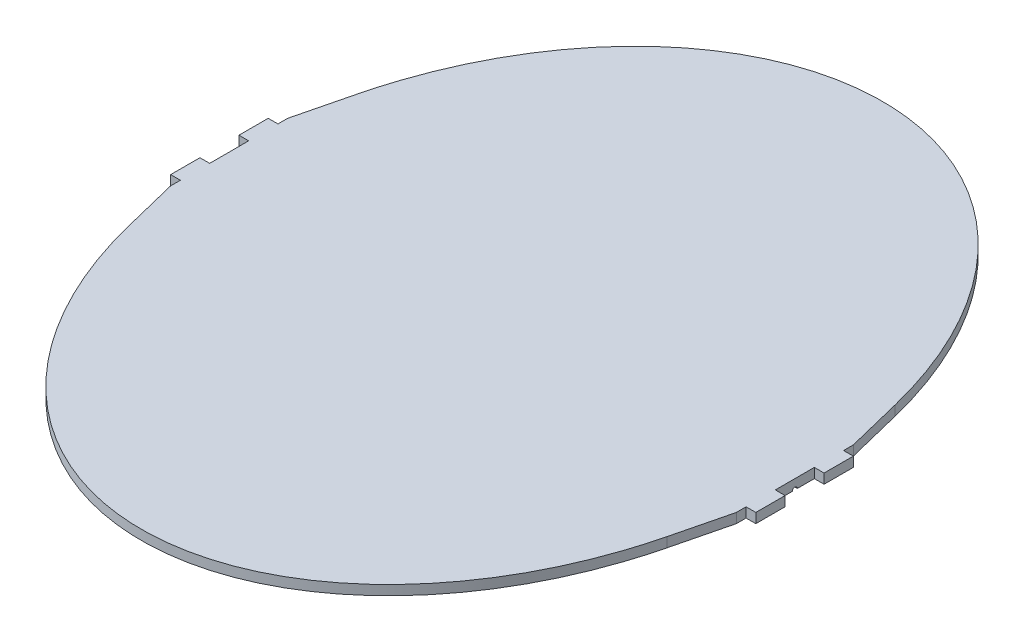
ISO-10303-21;
HEADER;
FILE_DESCRIPTION(('STEP AP214'),'2;1');
FILE_NAME('part.step','',(''),(''),'','','');
FILE_SCHEMA(('AUTOMOTIVE_DESIGN { 1 0 10303 214 1 1 1 1 }'));
ENDSEC;
DATA;
#1=APPLICATION_CONTEXT('core data for automotive mechanical design processes');
#2=APPLICATION_PROTOCOL_DEFINITION('international standard','automotive_design',2000,#1);
#3=PRODUCT_CONTEXT('',#1,'mechanical');
#4=PRODUCT('Part','Part','',(#3));
#5=PRODUCT_RELATED_PRODUCT_CATEGORY('part','',(#4));
#6=PRODUCT_DEFINITION_FORMATION('','',#4);
#7=PRODUCT_DEFINITION_CONTEXT('part definition',#1,'design');
#8=PRODUCT_DEFINITION('design','',#6,#7);
#9=PRODUCT_DEFINITION_SHAPE('','',#8);
#10=(LENGTH_UNIT() NAMED_UNIT(*) SI_UNIT(.MILLI.,.METRE.));
#11=(NAMED_UNIT(*) PLANE_ANGLE_UNIT() SI_UNIT($,.RADIAN.));
#12=(NAMED_UNIT(*) SI_UNIT($,.STERADIAN.) SOLID_ANGLE_UNIT());
#13=UNCERTAINTY_MEASURE_WITH_UNIT(LENGTH_MEASURE(1.E-05),#10,'distance_accuracy_value','');
#14=(GEOMETRIC_REPRESENTATION_CONTEXT(3) GLOBAL_UNCERTAINTY_ASSIGNED_CONTEXT((#13)) GLOBAL_UNIT_ASSIGNED_CONTEXT((#10,
#11,#12)) REPRESENTATION_CONTEXT('',''));
#15=CARTESIAN_POINT('',(0.,0.,0.));
#16=DIRECTION('',(0.,0.,1.));
#17=DIRECTION('',(1.,0.,0.));
#18=AXIS2_PLACEMENT_3D('',#15,#16,#17);
#19=CARTESIAN_POINT('',(0.,10.,0.));
#20=DIRECTION('',(0.,1.,0.));
#21=DIRECTION('',(0.,0.,-1.));
#22=AXIS2_PLACEMENT_3D('',#19,#20,#21);
#23=ELLIPSE('',#22,380.,290.);
#24=DIRECTION('',(0.,-1.,0.));
#25=VECTOR('',#24,1.);
#26=SURFACE_OF_LINEAR_EXTRUSION('',#23,#25);
#27=CARTESIAN_POINT('',(0.,0.,0.));
#28=DIRECTION('',(0.,1.,0.));
#29=DIRECTION('',(0.,0.,-1.));
#30=AXIS2_PLACEMENT_3D('',#27,#28,#29);
#31=ELLIPSE('',#30,380.,290.);
#32=CARTESIAN_POINT('',(275.891891891892,0.,-117.081081081081));
#33=VERTEX_POINT('',#32);
#34=CARTESIAN_POINT('',(-275.891891891892,0.,-117.081081081081));
#35=VERTEX_POINT('',#34);
#36=EDGE_CURVE('E38',#33,#35,#31,.T.);
#37=ORIENTED_EDGE('',*,*,#36,.T.);
#38=DIRECTION('',(0.,1.,0.));
#39=VECTOR('',#38,1.);
#40=CARTESIAN_POINT('',(-275.891891891892,0.,-117.081081081081));
#41=LINE('',#40,#39);
#42=CARTESIAN_POINT('',(-275.891891891892,10.,-117.081081081081));
#43=VERTEX_POINT('',#42);
#44=EDGE_CURVE('E336',#35,#43,#41,.T.);
#45=ORIENTED_EDGE('',*,*,#44,.T.);
#46=CARTESIAN_POINT('',(275.891891891892,10.,-117.081081081081));
#47=VERTEX_POINT('',#46);
#48=EDGE_CURVE('E11',#47,#43,#23,.T.);
#49=ORIENTED_EDGE('',*,*,#48,.F.);
#50=DIRECTION('',(0.,1.,0.));
#51=VECTOR('',#50,1.);
#52=CARTESIAN_POINT('',(275.891891891892,0.,-117.081081081081));
#53=LINE('',#52,#51);
#54=EDGE_CURVE('E405',#33,#47,#53,.T.);
#55=ORIENTED_EDGE('',*,*,#54,.F.);
#56=EDGE_LOOP('',(#37,#45,#49,#55));
#57=FACE_BOUND('',#56,.T.);
#58=ADVANCED_FACE('F33',(#57),#26,.F.);
#59=CARTESIAN_POINT('',(-275.891891891892,10.,117.081081081081));
#60=VERTEX_POINT('',#59);
#61=CARTESIAN_POINT('',(275.891891891892,10.,117.081081081081));
#62=VERTEX_POINT('',#61);
#63=EDGE_CURVE('E42',#60,#62,#23,.T.);
#64=ORIENTED_EDGE('',*,*,#63,.F.);
#65=DIRECTION('',(0.,1.,0.));
#66=VECTOR('',#65,1.);
#67=CARTESIAN_POINT('',(-275.891891891892,0.,117.081081081081));
#68=LINE('',#67,#66);
#69=CARTESIAN_POINT('',(-275.891891891892,0.,117.081081081081));
#70=VERTEX_POINT('',#69);
#71=EDGE_CURVE('E283',#70,#60,#68,.T.);
#72=ORIENTED_EDGE('',*,*,#71,.F.);
#73=CARTESIAN_POINT('',(275.891891891892,0.,117.081081081081));
#74=VERTEX_POINT('',#73);
#75=EDGE_CURVE('E408',#70,#74,#31,.T.);
#76=ORIENTED_EDGE('',*,*,#75,.T.);
#77=DIRECTION('',(0.,1.,0.));
#78=VECTOR('',#77,1.);
#79=CARTESIAN_POINT('',(275.891891891892,0.,117.081081081081));
#80=LINE('',#79,#78);
#81=EDGE_CURVE('E375',#74,#62,#80,.T.);
#82=ORIENTED_EDGE('',*,*,#81,.T.);
#83=EDGE_LOOP('',(#64,#72,#76,#82));
#84=FACE_BOUND('',#83,.T.);
#85=ADVANCED_FACE('F35',(#84),#26,.F.);
#86=CARTESIAN_POINT('',(0.,10.,0.));
#87=DIRECTION('',(0.,1.,0.));
#88=DIRECTION('',(0.,0.,1.));
#89=AXIS2_PLACEMENT_3D('',#86,#87,#88);
#90=PLANE('',#89);
#91=ORIENTED_EDGE('',*,*,#48,.T.);
#92=DIRECTION('',(-0.239939067208134,0.,0.970787950083483));
#93=VECTOR('',#92,1.);
#94=CARTESIAN_POINT('',(-275.891891891892,10.,-117.081081081081));
#95=LINE('',#94,#93);
#96=CARTESIAN_POINT('',(-290.,10.,-59.9999999999999));
#97=VERTEX_POINT('',#96);
#98=EDGE_CURVE('E285',#43,#97,#95,.T.);
#99=ORIENTED_EDGE('',*,*,#98,.T.);
#100=DIRECTION('',(0.,0.,1.));
#101=VECTOR('',#100,1.);
#102=CARTESIAN_POINT('',(-290.,10.,-59.9999999999999));
#103=LINE('',#102,#101);
#104=CARTESIAN_POINT('',(-290.,10.,-50.));
#105=VERTEX_POINT('',#104);
#106=EDGE_CURVE('E288',#97,#105,#103,.T.);
#107=ORIENTED_EDGE('',*,*,#106,.T.);
#108=DIRECTION('',(-1.,0.,0.));
#109=VECTOR('',#108,1.);
#110=CARTESIAN_POINT('',(-300.,10.,-50.));
#111=LINE('',#110,#109);
#112=CARTESIAN_POINT('',(-300.,10.,-50.));
#113=VERTEX_POINT('',#112);
#114=EDGE_CURVE('E291',#105,#113,#111,.T.);
#115=ORIENTED_EDGE('',*,*,#114,.T.);
#116=DIRECTION('',(0.,0.,1.));
#117=VECTOR('',#116,1.);
#118=CARTESIAN_POINT('',(-300.,10.,-20.));
#119=LINE('',#118,#117);
#120=CARTESIAN_POINT('',(-300.,10.,-20.));
#121=VERTEX_POINT('',#120);
#122=EDGE_CURVE('E294',#113,#121,#119,.T.);
#123=ORIENTED_EDGE('',*,*,#122,.T.);
#124=DIRECTION('',(1.,0.,0.));
#125=VECTOR('',#124,1.);
#126=CARTESIAN_POINT('',(-290.,10.,-19.9999999999999));
#127=LINE('',#126,#125);
#128=CARTESIAN_POINT('',(-290.,10.,-19.9999999999999));
#129=VERTEX_POINT('',#128);
#130=EDGE_CURVE('E297',#121,#129,#127,.T.);
#131=ORIENTED_EDGE('',*,*,#130,.T.);
#132=DIRECTION('',(0.,0.,1.));
#133=VECTOR('',#132,1.);
#134=CARTESIAN_POINT('',(-290.,10.,0.));
#135=LINE('',#134,#133);
#136=CARTESIAN_POINT('',(-290.,10.,20.0000000000001));
#137=VERTEX_POINT('',#136);
#138=EDGE_CURVE('E300',#129,#137,#135,.T.);
#139=ORIENTED_EDGE('',*,*,#138,.T.);
#140=DIRECTION('',(-1.,0.,0.));
#141=VECTOR('',#140,1.);
#142=CARTESIAN_POINT('',(-300.,10.,20.));
#143=LINE('',#142,#141);
#144=CARTESIAN_POINT('',(-300.,10.,20.));
#145=VERTEX_POINT('',#144);
#146=EDGE_CURVE('E302',#137,#145,#143,.T.);
#147=ORIENTED_EDGE('',*,*,#146,.T.);
#148=DIRECTION('',(0.,0.,1.));
#149=VECTOR('',#148,1.);
#150=CARTESIAN_POINT('',(-300.,10.,50.));
#151=LINE('',#150,#149);
#152=CARTESIAN_POINT('',(-300.,10.,50.));
#153=VERTEX_POINT('',#152);
#154=EDGE_CURVE('E305',#145,#153,#151,.T.);
#155=ORIENTED_EDGE('',*,*,#154,.T.);
#156=DIRECTION('',(1.,0.,0.));
#157=VECTOR('',#156,1.);
#158=CARTESIAN_POINT('',(-290.,10.,50.));
#159=LINE('',#158,#157);
#160=CARTESIAN_POINT('',(-290.,10.,50.));
#161=VERTEX_POINT('',#160);
#162=EDGE_CURVE('E308',#153,#161,#159,.T.);
#163=ORIENTED_EDGE('',*,*,#162,.T.);
#164=DIRECTION('',(0.,0.,1.));
#165=VECTOR('',#164,1.);
#166=CARTESIAN_POINT('',(-290.,10.,50.));
#167=LINE('',#166,#165);
#168=CARTESIAN_POINT('',(-290.,10.,59.9999999999999));
#169=VERTEX_POINT('',#168);
#170=EDGE_CURVE('E254',#161,#169,#167,.T.);
#171=ORIENTED_EDGE('',*,*,#170,.T.);
#172=DIRECTION('',(0.239939067208133,0.,0.970787950083483));
#173=VECTOR('',#172,1.);
#174=CARTESIAN_POINT('',(-290.,10.,59.9999999999999));
#175=LINE('',#174,#173);
#176=EDGE_CURVE('E248',#169,#60,#175,.T.);
#177=ORIENTED_EDGE('',*,*,#176,.T.);
#178=ORIENTED_EDGE('',*,*,#63,.T.);
#179=DIRECTION('',(0.239939067208134,0.,-0.970787950083483));
#180=VECTOR('',#179,1.);
#181=CARTESIAN_POINT('',(290.,10.,60.));
#182=LINE('',#181,#180);
#183=CARTESIAN_POINT('',(290.,10.,60.));
#184=VERTEX_POINT('',#183);
#185=EDGE_CURVE('E315',#62,#184,#182,.T.);
#186=ORIENTED_EDGE('',*,*,#185,.T.);
#187=DIRECTION('',(0.,0.,-1.));
#188=VECTOR('',#187,1.);
#189=CARTESIAN_POINT('',(290.,10.,50.));
#190=LINE('',#189,#188);
#191=CARTESIAN_POINT('',(290.,10.,50.));
#192=VERTEX_POINT('',#191);
#193=EDGE_CURVE('E378',#184,#192,#190,.T.);
#194=ORIENTED_EDGE('',*,*,#193,.T.);
#195=DIRECTION('',(1.,0.,0.));
#196=VECTOR('',#195,1.);
#197=CARTESIAN_POINT('',(290.,10.,50.));
#198=LINE('',#197,#196);
#199=CARTESIAN_POINT('',(300.,10.,50.));
#200=VERTEX_POINT('',#199);
#201=EDGE_CURVE('E381',#192,#200,#198,.T.);
#202=ORIENTED_EDGE('',*,*,#201,.T.);
#203=DIRECTION('',(0.,0.,-1.));
#204=VECTOR('',#203,1.);
#205=CARTESIAN_POINT('',(300.,10.,50.));
#206=LINE('',#205,#204);
#207=CARTESIAN_POINT('',(300.,10.,20.));
#208=VERTEX_POINT('',#207);
#209=EDGE_CURVE('E384',#200,#208,#206,.T.);
#210=ORIENTED_EDGE('',*,*,#209,.T.);
#211=DIRECTION('',(-1.,0.,0.));
#212=VECTOR('',#211,1.);
#213=CARTESIAN_POINT('',(300.,10.,20.));
#214=LINE('',#213,#212);
#215=CARTESIAN_POINT('',(290.,10.,20.));
#216=VERTEX_POINT('',#215);
#217=EDGE_CURVE('E387',#208,#216,#214,.T.);
#218=ORIENTED_EDGE('',*,*,#217,.T.);
#219=DIRECTION('',(0.,0.,-1.));
#220=VECTOR('',#219,1.);
#221=CARTESIAN_POINT('',(290.,10.,-20.));
#222=LINE('',#221,#220);
#223=CARTESIAN_POINT('',(290.,10.,-20.));
#224=VERTEX_POINT('',#223);
#225=EDGE_CURVE('E390',#216,#224,#222,.T.);
#226=ORIENTED_EDGE('',*,*,#225,.T.);
#227=DIRECTION('',(1.,0.,0.));
#228=VECTOR('',#227,1.);
#229=CARTESIAN_POINT('',(290.,10.,-20.));
#230=LINE('',#229,#228);
#231=CARTESIAN_POINT('',(300.,10.,-20.));
#232=VERTEX_POINT('',#231);
#233=EDGE_CURVE('E392',#224,#232,#230,.T.);
#234=ORIENTED_EDGE('',*,*,#233,.T.);
#235=DIRECTION('',(0.,0.,-1.));
#236=VECTOR('',#235,1.);
#237=CARTESIAN_POINT('',(300.,10.,-20.));
#238=LINE('',#237,#236);
#239=CARTESIAN_POINT('',(300.,10.,-50.));
#240=VERTEX_POINT('',#239);
#241=EDGE_CURVE('E395',#232,#240,#238,.T.);
#242=ORIENTED_EDGE('',*,*,#241,.T.);
#243=DIRECTION('',(-1.,0.,0.));
#244=VECTOR('',#243,1.);
#245=CARTESIAN_POINT('',(300.,10.,-50.));
#246=LINE('',#245,#244);
#247=CARTESIAN_POINT('',(290.,10.,-50.));
#248=VERTEX_POINT('',#247);
#249=EDGE_CURVE('E398',#240,#248,#246,.T.);
#250=ORIENTED_EDGE('',*,*,#249,.T.);
#251=DIRECTION('',(0.,0.,-1.));
#252=VECTOR('',#251,1.);
#253=CARTESIAN_POINT('',(290.,10.,-60.));
#254=LINE('',#253,#252);
#255=CARTESIAN_POINT('',(290.,10.,-60.));
#256=VERTEX_POINT('',#255);
#257=EDGE_CURVE('E401',#248,#256,#254,.T.);
#258=ORIENTED_EDGE('',*,*,#257,.T.);
#259=DIRECTION('',(-0.239939067208134,0.,-0.970787950083483));
#260=VECTOR('',#259,1.);
#261=CARTESIAN_POINT('',(275.891891891892,10.,-117.081081081081));
#262=LINE('',#261,#260);
#263=EDGE_CURVE('E345',#256,#47,#262,.T.);
#264=ORIENTED_EDGE('',*,*,#263,.T.);
#265=EDGE_LOOP('',(#91,#99,#107,#115,#123,#131,#139,#147,#155,#163,#171,#177,#178,#186,#194,
#202,#210,#218,#226,#234,#242,#250,#258,#264));
#266=FACE_BOUND('',#265,.T.);
#267=ADVANCED_FACE('F451',(#266),#90,.T.);
#268=CARTESIAN_POINT('',(0.,0.,0.));
#269=DIRECTION('',(0.,1.,0.));
#270=DIRECTION('',(0.,0.,1.));
#271=AXIS2_PLACEMENT_3D('',#268,#269,#270);
#272=PLANE('',#271);
#273=DIRECTION('',(0.,0.,1.));
#274=VECTOR('',#273,1.);
#275=CARTESIAN_POINT('',(-279.999999999999,0.,-57.5));
#276=LINE('',#275,#274);
#277=CARTESIAN_POINT('',(-279.999999999999,0.,-57.5));
#278=VERTEX_POINT('',#277);
#279=CARTESIAN_POINT('',(-279.999999999999,0.,-52.5));
#280=VERTEX_POINT('',#279);
#281=EDGE_CURVE('E227',#278,#280,#276,.T.);
#282=ORIENTED_EDGE('',*,*,#281,.F.);
#283=DIRECTION('',(-1.,0.,0.));
#284=VECTOR('',#283,1.);
#285=CARTESIAN_POINT('',(-279.999999999999,0.,-57.5));
#286=LINE('',#285,#284);
#287=CARTESIAN_POINT('',(-289.999999999999,0.,-57.5));
#288=VERTEX_POINT('',#287);
#289=EDGE_CURVE('E217',#278,#288,#286,.T.);
#290=ORIENTED_EDGE('',*,*,#289,.T.);
#291=DIRECTION('',(0.,0.,1.));
#292=VECTOR('',#291,1.);
#293=CARTESIAN_POINT('',(-290.,0.,-59.9999999999999));
#294=LINE('',#293,#292);
#295=CARTESIAN_POINT('',(-290.,0.,-59.9999999999999));
#296=VERTEX_POINT('',#295);
#297=EDGE_CURVE('E258',#296,#288,#294,.T.);
#298=ORIENTED_EDGE('',*,*,#297,.F.);
#299=DIRECTION('',(-0.239939067208134,0.,0.970787950083483));
#300=VECTOR('',#299,1.);
#301=CARTESIAN_POINT('',(-275.891891891892,0.,-117.081081081081));
#302=LINE('',#301,#300);
#303=EDGE_CURVE('E253',#35,#296,#302,.T.);
#304=ORIENTED_EDGE('',*,*,#303,.F.);
#305=ORIENTED_EDGE('',*,*,#36,.F.);
#306=DIRECTION('',(-0.239939067208134,0.,-0.970787950083483));
#307=VECTOR('',#306,1.);
#308=CARTESIAN_POINT('',(275.891891891892,0.,-117.081081081081));
#309=LINE('',#308,#307);
#310=CARTESIAN_POINT('',(290.,0.,-60.));
#311=VERTEX_POINT('',#310);
#312=EDGE_CURVE('E373',#311,#33,#309,.T.);
#313=ORIENTED_EDGE('',*,*,#312,.F.);
#314=DIRECTION('',(0.,0.,-1.));
#315=VECTOR('',#314,1.);
#316=CARTESIAN_POINT('',(290.,0.,-60.));
#317=LINE('',#316,#315);
#318=CARTESIAN_POINT('',(290.,0.,-50.));
#319=VERTEX_POINT('',#318);
#320=EDGE_CURVE('E370',#319,#311,#317,.T.);
#321=ORIENTED_EDGE('',*,*,#320,.F.);
#322=DIRECTION('',(-1.,0.,0.));
#323=VECTOR('',#322,1.);
#324=CARTESIAN_POINT('',(300.,0.,-50.));
#325=LINE('',#324,#323);
#326=CARTESIAN_POINT('',(300.,0.,-50.));
#327=VERTEX_POINT('',#326);
#328=EDGE_CURVE('E367',#327,#319,#325,.T.);
#329=ORIENTED_EDGE('',*,*,#328,.F.);
#330=DIRECTION('',(0.,0.,-1.));
#331=VECTOR('',#330,1.);
#332=CARTESIAN_POINT('',(300.,0.,-20.));
#333=LINE('',#332,#331);
#334=CARTESIAN_POINT('',(300.,0.,-20.));
#335=VERTEX_POINT('',#334);
#336=EDGE_CURVE('E364',#335,#327,#333,.T.);
#337=ORIENTED_EDGE('',*,*,#336,.F.);
#338=DIRECTION('',(1.,0.,0.));
#339=VECTOR('',#338,1.);
#340=CARTESIAN_POINT('',(290.,0.,-20.));
#341=LINE('',#340,#339);
#342=CARTESIAN_POINT('',(290.,0.,-20.));
#343=VERTEX_POINT('',#342);
#344=EDGE_CURVE('E361',#343,#335,#341,.T.);
#345=ORIENTED_EDGE('',*,*,#344,.F.);
#346=DIRECTION('',(0.,0.,-1.));
#347=VECTOR('',#346,1.);
#348=CARTESIAN_POINT('',(290.,0.,0.));
#349=LINE('',#348,#347);
#350=CARTESIAN_POINT('',(290.,0.,-2.5));
#351=VERTEX_POINT('',#350);
#352=EDGE_CURVE('E357',#351,#343,#349,.T.);
#353=ORIENTED_EDGE('',*,*,#352,.F.);
#354=DIRECTION('',(1.,0.,0.));
#355=VECTOR('',#354,1.);
#356=CARTESIAN_POINT('',(280.,0.,-2.5));
#357=LINE('',#356,#355);
#358=CARTESIAN_POINT('',(280.,0.,-2.5));
#359=VERTEX_POINT('',#358);
#360=EDGE_CURVE('E57',#359,#351,#357,.T.);
#361=ORIENTED_EDGE('',*,*,#360,.F.);
#362=DIRECTION('',(0.,0.,-1.));
#363=VECTOR('',#362,1.);
#364=CARTESIAN_POINT('',(280.,0.,2.5));
#365=LINE('',#364,#363);
#366=CARTESIAN_POINT('',(280.,0.,2.5));
#367=VERTEX_POINT('',#366);
#368=EDGE_CURVE('E242',#367,#359,#365,.T.);
#369=ORIENTED_EDGE('',*,*,#368,.F.);
#370=DIRECTION('',(1.,0.,0.));
#371=VECTOR('',#370,1.);
#372=CARTESIAN_POINT('',(280.,0.,2.5));
#373=LINE('',#372,#371);
#374=CARTESIAN_POINT('',(290.,0.,2.5));
#375=VERTEX_POINT('',#374);
#376=EDGE_CURVE('E245',#367,#375,#373,.T.);
#377=ORIENTED_EDGE('',*,*,#376,.T.);
#378=CARTESIAN_POINT('',(290.,0.,20.));
#379=VERTEX_POINT('',#378);
#380=EDGE_CURVE('E358',#379,#375,#349,.T.);
#381=ORIENTED_EDGE('',*,*,#380,.F.);
#382=DIRECTION('',(-1.,0.,0.));
#383=VECTOR('',#382,1.);
#384=CARTESIAN_POINT('',(300.,0.,20.));
#385=LINE('',#384,#383);
#386=CARTESIAN_POINT('',(300.,0.,20.));
#387=VERTEX_POINT('',#386);
#388=EDGE_CURVE('E354',#387,#379,#385,.T.);
#389=ORIENTED_EDGE('',*,*,#388,.F.);
#390=DIRECTION('',(0.,0.,-1.));
#391=VECTOR('',#390,1.);
#392=CARTESIAN_POINT('',(300.,0.,50.));
#393=LINE('',#392,#391);
#394=CARTESIAN_POINT('',(300.,0.,50.));
#395=VERTEX_POINT('',#394);
#396=EDGE_CURVE('E351',#395,#387,#393,.T.);
#397=ORIENTED_EDGE('',*,*,#396,.F.);
#398=DIRECTION('',(1.,0.,0.));
#399=VECTOR('',#398,1.);
#400=CARTESIAN_POINT('',(290.,0.,50.));
#401=LINE('',#400,#399);
#402=CARTESIAN_POINT('',(290.,0.,50.));
#403=VERTEX_POINT('',#402);
#404=EDGE_CURVE('E348',#403,#395,#401,.T.);
#405=ORIENTED_EDGE('',*,*,#404,.F.);
#406=DIRECTION('',(0.,0.,-1.));
#407=VECTOR('',#406,1.);
#408=CARTESIAN_POINT('',(290.,0.,50.));
#409=LINE('',#408,#407);
#410=CARTESIAN_POINT('',(290.,0.,60.));
#411=VERTEX_POINT('',#410);
#412=EDGE_CURVE('E344',#411,#403,#409,.T.);
#413=ORIENTED_EDGE('',*,*,#412,.F.);
#414=DIRECTION('',(0.239939067208134,0.,-0.970787950083483));
#415=VECTOR('',#414,1.);
#416=CARTESIAN_POINT('',(290.,0.,60.));
#417=LINE('',#416,#415);
#418=EDGE_CURVE('E341',#74,#411,#417,.T.);
#419=ORIENTED_EDGE('',*,*,#418,.F.);
#420=ORIENTED_EDGE('',*,*,#75,.F.);
#421=DIRECTION('',(0.239939067208133,0.,0.970787950083483));
#422=VECTOR('',#421,1.);
#423=CARTESIAN_POINT('',(-290.,0.,59.9999999999999));
#424=LINE('',#423,#422);
#425=CARTESIAN_POINT('',(-290.,0.,59.9999999999999));
#426=VERTEX_POINT('',#425);
#427=EDGE_CURVE('E251',#426,#70,#424,.T.);
#428=ORIENTED_EDGE('',*,*,#427,.F.);
#429=DIRECTION('',(0.,0.,1.));
#430=VECTOR('',#429,1.);
#431=CARTESIAN_POINT('',(-290.,0.,50.));
#432=LINE('',#431,#430);
#433=CARTESIAN_POINT('',(-290.,0.,50.));
#434=VERTEX_POINT('',#433);
#435=EDGE_CURVE('E280',#434,#426,#432,.T.);
#436=ORIENTED_EDGE('',*,*,#435,.F.);
#437=DIRECTION('',(1.,0.,0.));
#438=VECTOR('',#437,1.);
#439=CARTESIAN_POINT('',(-290.,0.,50.));
#440=LINE('',#439,#438);
#441=CARTESIAN_POINT('',(-300.,0.,50.));
#442=VERTEX_POINT('',#441);
#443=EDGE_CURVE('E277',#442,#434,#440,.T.);
#444=ORIENTED_EDGE('',*,*,#443,.F.);
#445=DIRECTION('',(0.,0.,1.));
#446=VECTOR('',#445,1.);
#447=CARTESIAN_POINT('',(-300.,0.,50.));
#448=LINE('',#447,#446);
#449=CARTESIAN_POINT('',(-300.,0.,20.));
#450=VERTEX_POINT('',#449);
#451=EDGE_CURVE('E274',#450,#442,#448,.T.);
#452=ORIENTED_EDGE('',*,*,#451,.F.);
#453=DIRECTION('',(-1.,0.,0.));
#454=VECTOR('',#453,1.);
#455=CARTESIAN_POINT('',(-300.,0.,20.));
#456=LINE('',#455,#454);
#457=CARTESIAN_POINT('',(-290.,0.,20.0000000000001));
#458=VERTEX_POINT('',#457);
#459=EDGE_CURVE('E271',#458,#450,#456,.T.);
#460=ORIENTED_EDGE('',*,*,#459,.F.);
#461=DIRECTION('',(0.,0.,1.));
#462=VECTOR('',#461,1.);
#463=CARTESIAN_POINT('',(-290.,0.,-19.9999999999999));
#464=LINE('',#463,#462);
#465=CARTESIAN_POINT('',(-290.,0.,-19.9999999999999));
#466=VERTEX_POINT('',#465);
#467=EDGE_CURVE('E269',#466,#458,#464,.T.);
#468=ORIENTED_EDGE('',*,*,#467,.F.);
#469=DIRECTION('',(1.,0.,0.));
#470=VECTOR('',#469,1.);
#471=CARTESIAN_POINT('',(-290.,0.,-19.9999999999999));
#472=LINE('',#471,#470);
#473=CARTESIAN_POINT('',(-300.,0.,-20.));
#474=VERTEX_POINT('',#473);
#475=EDGE_CURVE('E266',#474,#466,#472,.T.);
#476=ORIENTED_EDGE('',*,*,#475,.F.);
#477=DIRECTION('',(0.,0.,1.));
#478=VECTOR('',#477,1.);
#479=CARTESIAN_POINT('',(-300.,0.,-20.));
#480=LINE('',#479,#478);
#481=CARTESIAN_POINT('',(-300.,0.,-50.));
#482=VERTEX_POINT('',#481);
#483=EDGE_CURVE('E263',#482,#474,#480,.T.);
#484=ORIENTED_EDGE('',*,*,#483,.F.);
#485=DIRECTION('',(-1.,0.,0.));
#486=VECTOR('',#485,1.);
#487=CARTESIAN_POINT('',(-300.,0.,-50.));
#488=LINE('',#487,#486);
#489=CARTESIAN_POINT('',(-290.,0.,-50.));
#490=VERTEX_POINT('',#489);
#491=EDGE_CURVE('E260',#490,#482,#488,.T.);
#492=ORIENTED_EDGE('',*,*,#491,.F.);
#493=CARTESIAN_POINT('',(-290.,0.,-52.5));
#494=VERTEX_POINT('',#493);
#495=EDGE_CURVE('E257',#494,#490,#294,.T.);
#496=ORIENTED_EDGE('',*,*,#495,.F.);
#497=DIRECTION('',(-1.,0.,0.));
#498=VECTOR('',#497,1.);
#499=CARTESIAN_POINT('',(-279.999999999999,0.,-52.5));
#500=LINE('',#499,#498);
#501=EDGE_CURVE('E49',#280,#494,#500,.T.);
#502=ORIENTED_EDGE('',*,*,#501,.F.);
#503=EDGE_LOOP('',(#282,#290,#298,#304,#305,#313,#321,#329,#337,#345,#353,#361,#369,#377,#381,
#389,#397,#405,#413,#419,#420,#428,#436,#444,#452,#460,#468,#476,#484,#492,#496,#502));
#504=FACE_BOUND('',#503,.T.);
#505=ADVANCED_FACE('F232',(#504),#272,.F.);
#506=CARTESIAN_POINT('',(290.,0.,-20.));
#507=DIRECTION('',(1.,0.,0.));
#508=DIRECTION('',(0.,0.,-1.));
#509=AXIS2_PLACEMENT_3D('',#506,#507,#508);
#510=PLANE('',#509);
#511=CARTESIAN_POINT('',(290.,0.,0.));
#512=DIRECTION('',(1.,0.,0.));
#513=DIRECTION('',(0.,0.,-1.));
#514=AXIS2_PLACEMENT_3D('',#511,#512,#513);
#515=CIRCLE('',#514,2.5);
#516=EDGE_CURVE('E237',#351,#375,#515,.T.);
#517=ORIENTED_EDGE('',*,*,#516,.F.);
#518=ORIENTED_EDGE('',*,*,#352,.T.);
#519=DIRECTION('',(0.,1.,0.));
#520=VECTOR('',#519,1.);
#521=CARTESIAN_POINT('',(290.,0.,-20.));
#522=LINE('',#521,#520);
#523=EDGE_CURVE('E417',#343,#224,#522,.T.);
#524=ORIENTED_EDGE('',*,*,#523,.T.);
#525=ORIENTED_EDGE('',*,*,#225,.F.);
#526=DIRECTION('',(0.,1.,0.));
#527=VECTOR('',#526,1.);
#528=CARTESIAN_POINT('',(290.,0.,20.));
#529=LINE('',#528,#527);
#530=EDGE_CURVE('E420',#379,#216,#529,.T.);
#531=ORIENTED_EDGE('',*,*,#530,.F.);
#532=ORIENTED_EDGE('',*,*,#380,.T.);
#533=EDGE_LOOP('',(#517,#518,#524,#525,#531,#532));
#534=FACE_BOUND('',#533,.T.);
#535=ADVANCED_FACE('F485',(#534),#510,.T.);
#536=CARTESIAN_POINT('',(275.891891891892,0.,-117.081081081081));
#537=DIRECTION('',(0.970787950083483,0.,-0.239939067208134));
#538=DIRECTION('',(-0.239939067208134,0.,-0.970787950083483));
#539=AXIS2_PLACEMENT_3D('',#536,#537,#538);
#540=PLANE('',#539);
#541=ORIENTED_EDGE('',*,*,#263,.F.);
#542=DIRECTION('',(0.,1.,0.));
#543=VECTOR('',#542,1.);
#544=CARTESIAN_POINT('',(290.,0.,-60.));
#545=LINE('',#544,#543);
#546=EDGE_CURVE('E409',#311,#256,#545,.T.);
#547=ORIENTED_EDGE('',*,*,#546,.F.);
#548=ORIENTED_EDGE('',*,*,#312,.T.);
#549=ORIENTED_EDGE('',*,*,#54,.T.);
#550=EDGE_LOOP('',(#541,#547,#548,#549));
#551=FACE_BOUND('',#550,.T.);
#552=ADVANCED_FACE('F467',(#551),#540,.T.);
#553=CARTESIAN_POINT('',(290.,0.,-60.));
#554=DIRECTION('',(1.,0.,0.));
#555=DIRECTION('',(0.,0.,-1.));
#556=AXIS2_PLACEMENT_3D('',#553,#554,#555);
#557=PLANE('',#556);
#558=ORIENTED_EDGE('',*,*,#257,.F.);
#559=DIRECTION('',(0.,1.,0.));
#560=VECTOR('',#559,1.);
#561=CARTESIAN_POINT('',(290.,0.,-50.));
#562=LINE('',#561,#560);
#563=EDGE_CURVE('E411',#319,#248,#562,.T.);
#564=ORIENTED_EDGE('',*,*,#563,.F.);
#565=ORIENTED_EDGE('',*,*,#320,.T.);
#566=ORIENTED_EDGE('',*,*,#546,.T.);
#567=EDGE_LOOP('',(#558,#564,#565,#566));
#568=FACE_BOUND('',#567,.T.);
#569=ADVANCED_FACE('F469',(#568),#557,.T.);
#570=CARTESIAN_POINT('',(300.,0.,-50.));
#571=DIRECTION('',(0.,0.,-1.));
#572=DIRECTION('',(-1.,0.,0.));
#573=AXIS2_PLACEMENT_3D('',#570,#571,#572);
#574=PLANE('',#573);
#575=ORIENTED_EDGE('',*,*,#249,.F.);
#576=DIRECTION('',(0.,1.,0.));
#577=VECTOR('',#576,1.);
#578=CARTESIAN_POINT('',(300.,0.,-50.));
#579=LINE('',#578,#577);
#580=EDGE_CURVE('E413',#327,#240,#579,.T.);
#581=ORIENTED_EDGE('',*,*,#580,.F.);
#582=ORIENTED_EDGE('',*,*,#328,.T.);
#583=ORIENTED_EDGE('',*,*,#563,.T.);
#584=EDGE_LOOP('',(#575,#581,#582,#583));
#585=FACE_BOUND('',#584,.T.);
#586=ADVANCED_FACE('F474',(#585),#574,.T.);
#587=CARTESIAN_POINT('',(300.,0.,-20.));
#588=DIRECTION('',(1.,0.,0.));
#589=DIRECTION('',(0.,0.,-1.));
#590=AXIS2_PLACEMENT_3D('',#587,#588,#589);
#591=PLANE('',#590);
#592=ORIENTED_EDGE('',*,*,#241,.F.);
#593=DIRECTION('',(0.,1.,0.));
#594=VECTOR('',#593,1.);
#595=CARTESIAN_POINT('',(300.,0.,-20.));
#596=LINE('',#595,#594);
#597=EDGE_CURVE('E415',#335,#232,#596,.T.);
#598=ORIENTED_EDGE('',*,*,#597,.F.);
#599=ORIENTED_EDGE('',*,*,#336,.T.);
#600=ORIENTED_EDGE('',*,*,#580,.T.);
#601=EDGE_LOOP('',(#592,#598,#599,#600));
#602=FACE_BOUND('',#601,.T.);
#603=ADVANCED_FACE('F477',(#602),#591,.T.);
#604=CARTESIAN_POINT('',(290.,0.,-20.));
#605=DIRECTION('',(0.,0.,1.));
#606=DIRECTION('',(1.,0.,0.));
#607=AXIS2_PLACEMENT_3D('',#604,#605,#606);
#608=PLANE('',#607);
#609=ORIENTED_EDGE('',*,*,#233,.F.);
#610=ORIENTED_EDGE('',*,*,#523,.F.);
#611=ORIENTED_EDGE('',*,*,#344,.T.);
#612=ORIENTED_EDGE('',*,*,#597,.T.);
#613=EDGE_LOOP('',(#609,#610,#611,#612));
#614=FACE_BOUND('',#613,.T.);
#615=ADVANCED_FACE('F483',(#614),#608,.T.);
#616=CARTESIAN_POINT('',(300.,0.,20.));
#617=DIRECTION('',(0.,0.,-1.));
#618=DIRECTION('',(-1.,0.,0.));
#619=AXIS2_PLACEMENT_3D('',#616,#617,#618);
#620=PLANE('',#619);
#621=ORIENTED_EDGE('',*,*,#217,.F.);
#622=DIRECTION('',(0.,1.,0.));
#623=VECTOR('',#622,1.);
#624=CARTESIAN_POINT('',(300.,0.,20.));
#625=LINE('',#624,#623);
#626=EDGE_CURVE('E423',#387,#208,#625,.T.);
#627=ORIENTED_EDGE('',*,*,#626,.F.);
#628=ORIENTED_EDGE('',*,*,#388,.T.);
#629=ORIENTED_EDGE('',*,*,#530,.T.);
#630=EDGE_LOOP('',(#621,#627,#628,#629));
#631=FACE_BOUND('',#630,.T.);
#632=ADVANCED_FACE('F525',(#631),#620,.T.);
#633=CARTESIAN_POINT('',(300.,0.,50.));
#634=DIRECTION('',(1.,0.,0.));
#635=DIRECTION('',(0.,0.,-1.));
#636=AXIS2_PLACEMENT_3D('',#633,#634,#635);
#637=PLANE('',#636);
#638=ORIENTED_EDGE('',*,*,#209,.F.);
#639=DIRECTION('',(0.,1.,0.));
#640=VECTOR('',#639,1.);
#641=CARTESIAN_POINT('',(300.,0.,50.));
#642=LINE('',#641,#640);
#643=EDGE_CURVE('E425',#395,#200,#642,.T.);
#644=ORIENTED_EDGE('',*,*,#643,.F.);
#645=ORIENTED_EDGE('',*,*,#396,.T.);
#646=ORIENTED_EDGE('',*,*,#626,.T.);
#647=EDGE_LOOP('',(#638,#644,#645,#646));
#648=FACE_BOUND('',#647,.T.);
#649=ADVANCED_FACE('F521',(#648),#637,.T.);
#650=CARTESIAN_POINT('',(290.,0.,50.));
#651=DIRECTION('',(0.,0.,1.));
#652=DIRECTION('',(1.,0.,0.));
#653=AXIS2_PLACEMENT_3D('',#650,#651,#652);
#654=PLANE('',#653);
#655=ORIENTED_EDGE('',*,*,#201,.F.);
#656=DIRECTION('',(0.,1.,0.));
#657=VECTOR('',#656,1.);
#658=CARTESIAN_POINT('',(290.,0.,50.));
#659=LINE('',#658,#657);
#660=EDGE_CURVE('E427',#403,#192,#659,.T.);
#661=ORIENTED_EDGE('',*,*,#660,.F.);
#662=ORIENTED_EDGE('',*,*,#404,.T.);
#663=ORIENTED_EDGE('',*,*,#643,.T.);
#664=EDGE_LOOP('',(#655,#661,#662,#663));
#665=FACE_BOUND('',#664,.T.);
#666=ADVANCED_FACE('F518',(#665),#654,.T.);
#667=CARTESIAN_POINT('',(290.,0.,50.));
#668=DIRECTION('',(1.,0.,0.));
#669=DIRECTION('',(0.,0.,-1.));
#670=AXIS2_PLACEMENT_3D('',#667,#668,#669);
#671=PLANE('',#670);
#672=ORIENTED_EDGE('',*,*,#193,.F.);
#673=DIRECTION('',(0.,1.,0.));
#674=VECTOR('',#673,1.);
#675=CARTESIAN_POINT('',(290.,0.,60.));
#676=LINE('',#675,#674);
#677=EDGE_CURVE('E429',#411,#184,#676,.T.);
#678=ORIENTED_EDGE('',*,*,#677,.F.);
#679=ORIENTED_EDGE('',*,*,#412,.T.);
#680=ORIENTED_EDGE('',*,*,#660,.T.);
#681=EDGE_LOOP('',(#672,#678,#679,#680));
#682=FACE_BOUND('',#681,.T.);
#683=ADVANCED_FACE('F448',(#682),#671,.T.);
#684=CARTESIAN_POINT('',(290.,0.,60.));
#685=DIRECTION('',(0.970787950083483,0.,0.239939067208134));
#686=DIRECTION('',(0.239939067208134,0.,-0.970787950083483));
#687=AXIS2_PLACEMENT_3D('',#684,#685,#686);
#688=PLANE('',#687);
#689=ORIENTED_EDGE('',*,*,#185,.F.);
#690=ORIENTED_EDGE('',*,*,#81,.F.);
#691=ORIENTED_EDGE('',*,*,#418,.T.);
#692=ORIENTED_EDGE('',*,*,#677,.T.);
#693=EDGE_LOOP('',(#689,#690,#691,#692));
#694=FACE_BOUND('',#693,.T.);
#695=ADVANCED_FACE('F441',(#694),#688,.T.);
#696=CARTESIAN_POINT('',(-290.,0.,0.));
#697=DIRECTION('',(-1.,0.,0.));
#698=DIRECTION('',(0.,0.,1.));
#699=AXIS2_PLACEMENT_3D('',#696,#697,#698);
#700=PLANE('',#699);
#701=ORIENTED_EDGE('',*,*,#467,.T.);
#702=DIRECTION('',(0.,1.,0.));
#703=VECTOR('',#702,1.);
#704=CARTESIAN_POINT('',(-290.,0.,20.0000000000001));
#705=LINE('',#704,#703);
#706=EDGE_CURVE('E322',#458,#137,#705,.T.);
#707=ORIENTED_EDGE('',*,*,#706,.T.);
#708=ORIENTED_EDGE('',*,*,#138,.F.);
#709=DIRECTION('',(0.,1.,0.));
#710=VECTOR('',#709,1.);
#711=CARTESIAN_POINT('',(-290.,0.,-19.9999999999999));
#712=LINE('',#711,#710);
#713=EDGE_CURVE('E325',#466,#129,#712,.T.);
#714=ORIENTED_EDGE('',*,*,#713,.F.);
#715=EDGE_LOOP('',(#701,#707,#708,#714));
#716=FACE_BOUND('',#715,.T.);
#717=ADVANCED_FACE('F515',(#716),#700,.T.);
#718=CARTESIAN_POINT('',(-290.,0.,59.9999999999999));
#719=DIRECTION('',(-0.970787950083483,0.,0.239939067208133));
#720=DIRECTION('',(0.239939067208133,0.,0.970787950083483));
#721=AXIS2_PLACEMENT_3D('',#718,#719,#720);
#722=PLANE('',#721);
#723=ORIENTED_EDGE('',*,*,#176,.F.);
#724=DIRECTION('',(0.,1.,0.));
#725=VECTOR('',#724,1.);
#726=CARTESIAN_POINT('',(-290.,0.,59.9999999999999));
#727=LINE('',#726,#725);
#728=EDGE_CURVE('E313',#426,#169,#727,.T.);
#729=ORIENTED_EDGE('',*,*,#728,.F.);
#730=ORIENTED_EDGE('',*,*,#427,.T.);
#731=ORIENTED_EDGE('',*,*,#71,.T.);
#732=EDGE_LOOP('',(#723,#729,#730,#731));
#733=FACE_BOUND('',#732,.T.);
#734=ADVANCED_FACE('F542',(#733),#722,.T.);
#735=CARTESIAN_POINT('',(-290.,0.,50.));
#736=DIRECTION('',(-1.,0.,0.));
#737=DIRECTION('',(0.,0.,1.));
#738=AXIS2_PLACEMENT_3D('',#735,#736,#737);
#739=PLANE('',#738);
#740=ORIENTED_EDGE('',*,*,#170,.F.);
#741=DIRECTION('',(0.,1.,0.));
#742=VECTOR('',#741,1.);
#743=CARTESIAN_POINT('',(-290.,0.,50.));
#744=LINE('',#743,#742);
#745=EDGE_CURVE('E316',#434,#161,#744,.T.);
#746=ORIENTED_EDGE('',*,*,#745,.F.);
#747=ORIENTED_EDGE('',*,*,#435,.T.);
#748=ORIENTED_EDGE('',*,*,#728,.T.);
#749=EDGE_LOOP('',(#740,#746,#747,#748));
#750=FACE_BOUND('',#749,.T.);
#751=ADVANCED_FACE('F544',(#750),#739,.T.);
#752=CARTESIAN_POINT('',(-290.,0.,50.));
#753=DIRECTION('',(0.,0.,1.));
#754=DIRECTION('',(1.,0.,0.));
#755=AXIS2_PLACEMENT_3D('',#752,#753,#754);
#756=PLANE('',#755);
#757=ORIENTED_EDGE('',*,*,#162,.F.);
#758=DIRECTION('',(0.,1.,0.));
#759=VECTOR('',#758,1.);
#760=CARTESIAN_POINT('',(-300.,0.,50.));
#761=LINE('',#760,#759);
#762=EDGE_CURVE('E318',#442,#153,#761,.T.);
#763=ORIENTED_EDGE('',*,*,#762,.F.);
#764=ORIENTED_EDGE('',*,*,#443,.T.);
#765=ORIENTED_EDGE('',*,*,#745,.T.);
#766=EDGE_LOOP('',(#757,#763,#764,#765));
#767=FACE_BOUND('',#766,.T.);
#768=ADVANCED_FACE('F572',(#767),#756,.T.);
#769=CARTESIAN_POINT('',(-300.,0.,50.));
#770=DIRECTION('',(-1.,0.,0.));
#771=DIRECTION('',(0.,0.,1.));
#772=AXIS2_PLACEMENT_3D('',#769,#770,#771);
#773=PLANE('',#772);
#774=ORIENTED_EDGE('',*,*,#154,.F.);
#775=DIRECTION('',(0.,1.,0.));
#776=VECTOR('',#775,1.);
#777=CARTESIAN_POINT('',(-300.,0.,20.));
#778=LINE('',#777,#776);
#779=EDGE_CURVE('E320',#450,#145,#778,.T.);
#780=ORIENTED_EDGE('',*,*,#779,.F.);
#781=ORIENTED_EDGE('',*,*,#451,.T.);
#782=ORIENTED_EDGE('',*,*,#762,.T.);
#783=EDGE_LOOP('',(#774,#780,#781,#782));
#784=FACE_BOUND('',#783,.T.);
#785=ADVANCED_FACE('F568',(#784),#773,.T.);
#786=CARTESIAN_POINT('',(-300.,0.,20.));
#787=DIRECTION('',(0.,0.,-1.));
#788=DIRECTION('',(-1.,0.,0.));
#789=AXIS2_PLACEMENT_3D('',#786,#787,#788);
#790=PLANE('',#789);
#791=ORIENTED_EDGE('',*,*,#146,.F.);
#792=ORIENTED_EDGE('',*,*,#706,.F.);
#793=ORIENTED_EDGE('',*,*,#459,.T.);
#794=ORIENTED_EDGE('',*,*,#779,.T.);
#795=EDGE_LOOP('',(#791,#792,#793,#794));
#796=FACE_BOUND('',#795,.T.);
#797=ADVANCED_FACE('F561',(#796),#790,.T.);
#798=CARTESIAN_POINT('',(-290.,0.,-19.9999999999999));
#799=DIRECTION('',(0.,0.,1.));
#800=DIRECTION('',(1.,0.,0.));
#801=AXIS2_PLACEMENT_3D('',#798,#799,#800);
#802=PLANE('',#801);
#803=ORIENTED_EDGE('',*,*,#130,.F.);
#804=DIRECTION('',(0.,1.,0.));
#805=VECTOR('',#804,1.);
#806=CARTESIAN_POINT('',(-300.,0.,-20.));
#807=LINE('',#806,#805);
#808=EDGE_CURVE('E328',#474,#121,#807,.T.);
#809=ORIENTED_EDGE('',*,*,#808,.F.);
#810=ORIENTED_EDGE('',*,*,#475,.T.);
#811=ORIENTED_EDGE('',*,*,#713,.T.);
#812=EDGE_LOOP('',(#803,#809,#810,#811));
#813=FACE_BOUND('',#812,.T.);
#814=ADVANCED_FACE('F557',(#813),#802,.T.);
#815=CARTESIAN_POINT('',(-300.,0.,-20.));
#816=DIRECTION('',(-1.,0.,0.));
#817=DIRECTION('',(0.,0.,1.));
#818=AXIS2_PLACEMENT_3D('',#815,#816,#817);
#819=PLANE('',#818);
#820=ORIENTED_EDGE('',*,*,#122,.F.);
#821=DIRECTION('',(0.,1.,0.));
#822=VECTOR('',#821,1.);
#823=CARTESIAN_POINT('',(-300.,0.,-50.));
#824=LINE('',#823,#822);
#825=EDGE_CURVE('E330',#482,#113,#824,.T.);
#826=ORIENTED_EDGE('',*,*,#825,.F.);
#827=ORIENTED_EDGE('',*,*,#483,.T.);
#828=ORIENTED_EDGE('',*,*,#808,.T.);
#829=EDGE_LOOP('',(#820,#826,#827,#828));
#830=FACE_BOUND('',#829,.T.);
#831=ADVANCED_FACE('F553',(#830),#819,.T.);
#832=CARTESIAN_POINT('',(-300.,0.,-50.));
#833=DIRECTION('',(0.,0.,-1.));
#834=DIRECTION('',(-1.,0.,0.));
#835=AXIS2_PLACEMENT_3D('',#832,#833,#834);
#836=PLANE('',#835);
#837=ORIENTED_EDGE('',*,*,#114,.F.);
#838=DIRECTION('',(0.,1.,0.));
#839=VECTOR('',#838,1.);
#840=CARTESIAN_POINT('',(-290.,0.,-50.));
#841=LINE('',#840,#839);
#842=EDGE_CURVE('E332',#490,#105,#841,.T.);
#843=ORIENTED_EDGE('',*,*,#842,.F.);
#844=ORIENTED_EDGE('',*,*,#491,.T.);
#845=ORIENTED_EDGE('',*,*,#825,.T.);
#846=EDGE_LOOP('',(#837,#843,#844,#845));
#847=FACE_BOUND('',#846,.T.);
#848=ADVANCED_FACE('F549',(#847),#836,.T.);
#849=CARTESIAN_POINT('',(-290.,0.,-59.9999999999999));
#850=DIRECTION('',(-1.,0.,0.));
#851=DIRECTION('',(0.,0.,1.));
#852=AXIS2_PLACEMENT_3D('',#849,#850,#851);
#853=PLANE('',#852);
#854=CARTESIAN_POINT('',(-289.999999999999,0.,-55.));
#855=DIRECTION('',(-1.,0.,0.));
#856=DIRECTION('',(0.,0.,1.));
#857=AXIS2_PLACEMENT_3D('',#854,#855,#856);
#858=CIRCLE('',#857,2.5);
#859=EDGE_CURVE('E222',#494,#288,#858,.T.);
#860=ORIENTED_EDGE('',*,*,#859,.F.);
#861=ORIENTED_EDGE('',*,*,#495,.T.);
#862=ORIENTED_EDGE('',*,*,#842,.T.);
#863=ORIENTED_EDGE('',*,*,#106,.F.);
#864=DIRECTION('',(0.,1.,0.));
#865=VECTOR('',#864,1.);
#866=CARTESIAN_POINT('',(-290.,0.,-59.9999999999999));
#867=LINE('',#866,#865);
#868=EDGE_CURVE('E334',#296,#97,#867,.T.);
#869=ORIENTED_EDGE('',*,*,#868,.F.);
#870=ORIENTED_EDGE('',*,*,#297,.T.);
#871=EDGE_LOOP('',(#860,#861,#862,#863,#869,#870));
#872=FACE_BOUND('',#871,.T.);
#873=ADVANCED_FACE('F498',(#872),#853,.T.);
#874=CARTESIAN_POINT('',(-275.891891891892,0.,-117.081081081081));
#875=DIRECTION('',(-0.970787950083483,0.,-0.239939067208134));
#876=DIRECTION('',(-0.239939067208134,0.,0.970787950083483));
#877=AXIS2_PLACEMENT_3D('',#874,#875,#876);
#878=PLANE('',#877);
#879=ORIENTED_EDGE('',*,*,#98,.F.);
#880=ORIENTED_EDGE('',*,*,#44,.F.);
#881=ORIENTED_EDGE('',*,*,#303,.T.);
#882=ORIENTED_EDGE('',*,*,#868,.T.);
#883=EDGE_LOOP('',(#879,#880,#881,#882));
#884=FACE_BOUND('',#883,.T.);
#885=ADVANCED_FACE('F462',(#884),#878,.T.);
#886=CARTESIAN_POINT('',(280.,0.,0.));
#887=DIRECTION('',(1.,0.,0.));
#888=DIRECTION('',(0.,0.,-1.));
#889=AXIS2_PLACEMENT_3D('',#886,#887,#888);
#890=CYLINDRICAL_SURFACE('',#889,2.5);
#891=ORIENTED_EDGE('',*,*,#516,.T.);
#892=ORIENTED_EDGE('',*,*,#376,.F.);
#893=CARTESIAN_POINT('',(280.,0.,0.));
#894=DIRECTION('',(1.,0.,0.));
#895=DIRECTION('',(0.,0.,-1.));
#896=AXIS2_PLACEMENT_3D('',#893,#894,#895);
#897=CIRCLE('',#896,2.5);
#898=EDGE_CURVE('E239',#359,#367,#897,.T.);
#899=ORIENTED_EDGE('',*,*,#898,.F.);
#900=ORIENTED_EDGE('',*,*,#360,.T.);
#901=EDGE_LOOP('',(#891,#892,#899,#900));
#902=FACE_BOUND('',#901,.T.);
#903=ADVANCED_FACE('F490',(#902),#890,.F.);
#904=CARTESIAN_POINT('',(280.,0.,0.));
#905=DIRECTION('',(1.,0.,0.));
#906=DIRECTION('',(0.,0.,-1.));
#907=AXIS2_PLACEMENT_3D('',#904,#905,#906);
#908=PLANE('',#907);
#909=ORIENTED_EDGE('',*,*,#898,.T.);
#910=ORIENTED_EDGE('',*,*,#368,.T.);
#911=EDGE_LOOP('',(#909,#910));
#912=FACE_BOUND('',#911,.T.);
#913=ADVANCED_FACE('F489',(#912),#908,.T.);
#914=CARTESIAN_POINT('',(-279.999999999999,0.,-55.));
#915=DIRECTION('',(-1.,0.,0.));
#916=DIRECTION('',(0.,0.,1.));
#917=AXIS2_PLACEMENT_3D('',#914,#915,#916);
#918=CYLINDRICAL_SURFACE('',#917,2.5);
#919=ORIENTED_EDGE('',*,*,#859,.T.);
#920=ORIENTED_EDGE('',*,*,#289,.F.);
#921=CARTESIAN_POINT('',(-279.999999999999,0.,-55.));
#922=DIRECTION('',(-1.,0.,0.));
#923=DIRECTION('',(0.,0.,1.));
#924=AXIS2_PLACEMENT_3D('',#921,#922,#923);
#925=CIRCLE('',#924,2.5);
#926=EDGE_CURVE('E220',#280,#278,#925,.T.);
#927=ORIENTED_EDGE('',*,*,#926,.F.);
#928=ORIENTED_EDGE('',*,*,#501,.T.);
#929=EDGE_LOOP('',(#919,#920,#927,#928));
#930=FACE_BOUND('',#929,.T.);
#931=ADVANCED_FACE('F219',(#930),#918,.F.);
#932=CARTESIAN_POINT('',(-279.999999999999,0.,-55.));
#933=DIRECTION('',(-1.,0.,0.));
#934=DIRECTION('',(0.,0.,1.));
#935=AXIS2_PLACEMENT_3D('',#932,#933,#934);
#936=PLANE('',#935);
#937=ORIENTED_EDGE('',*,*,#926,.T.);
#938=ORIENTED_EDGE('',*,*,#281,.T.);
#939=EDGE_LOOP('',(#937,#938));
#940=FACE_BOUND('',#939,.T.);
#941=ADVANCED_FACE('F230',(#940),#936,.T.);
#942=CLOSED_SHELL('',(#58,#85,#267,#505,#535,#552,#569,#586,#603,#615,#632,#649,#666,#683,#695,
#717,#734,#751,#768,#785,#797,#814,#831,#848,#873,#885,#903,#913,#931,#941));
#943=MANIFOLD_SOLID_BREP('B2',#942);
#944=ADVANCED_BREP_SHAPE_REPRESENTATION('',(#18,#943),#14);
#945=SHAPE_DEFINITION_REPRESENTATION(#9,#944);
ENDSEC;
END-ISO-10303-21;
